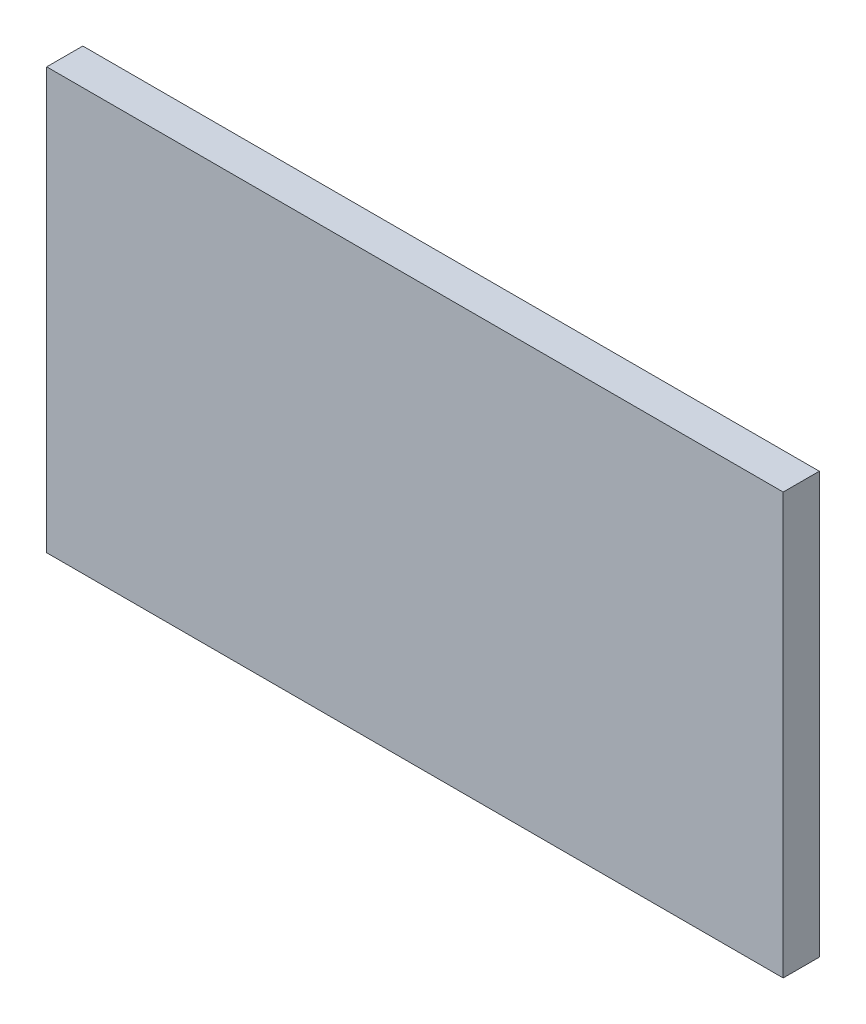
ISO-10303-21;
HEADER;
FILE_DESCRIPTION(('STEP AP214'),'2;1');
FILE_NAME('part.step','',(''),(''),'','','');
FILE_SCHEMA(('AUTOMOTIVE_DESIGN { 1 0 10303 214 1 1 1 1 }'));
ENDSEC;
DATA;
#1=APPLICATION_CONTEXT('core data for automotive mechanical design processes');
#2=APPLICATION_PROTOCOL_DEFINITION('international standard','automotive_design',2000,#1);
#3=PRODUCT_CONTEXT('',#1,'mechanical');
#4=PRODUCT('Part','Part','',(#3));
#5=PRODUCT_RELATED_PRODUCT_CATEGORY('part','',(#4));
#6=PRODUCT_DEFINITION_FORMATION('','',#4);
#7=PRODUCT_DEFINITION_CONTEXT('part definition',#1,'design');
#8=PRODUCT_DEFINITION('design','',#6,#7);
#9=PRODUCT_DEFINITION_SHAPE('','',#8);
#10=(LENGTH_UNIT() NAMED_UNIT(*) SI_UNIT(.MILLI.,.METRE.));
#11=(NAMED_UNIT(*) PLANE_ANGLE_UNIT() SI_UNIT($,.RADIAN.));
#12=(NAMED_UNIT(*) SI_UNIT($,.STERADIAN.) SOLID_ANGLE_UNIT());
#13=UNCERTAINTY_MEASURE_WITH_UNIT(LENGTH_MEASURE(1.E-05),#10,'distance_accuracy_value','');
#14=(GEOMETRIC_REPRESENTATION_CONTEXT(3) GLOBAL_UNCERTAINTY_ASSIGNED_CONTEXT((#13)) GLOBAL_UNIT_ASSIGNED_CONTEXT((#10,
#11,#12)) REPRESENTATION_CONTEXT('',''));
#15=CARTESIAN_POINT('',(0.,0.,0.));
#16=DIRECTION('',(0.,0.,1.));
#17=DIRECTION('',(1.,0.,0.));
#18=AXIS2_PLACEMENT_3D('',#15,#16,#17);
#19=CARTESIAN_POINT('',(1.65,8.0716,0.76487));
#20=DIRECTION('',(0.,0.,-1.));
#21=DIRECTION('',(0.,1.,0.));
#22=AXIS2_PLACEMENT_3D('',#19,#20,#21);
#23=PLANE('',#22);
#24=DIRECTION('',(1.,0.,0.));
#25=VECTOR('',#24,1.);
#26=CARTESIAN_POINT('',(1.3,8.2716,0.76487));
#27=LINE('',#26,#25);
#28=CARTESIAN_POINT('',(1.3,8.2716,0.76487));
#29=VERTEX_POINT('',#28);
#30=CARTESIAN_POINT('',(2.,8.2716,0.76487));
#31=VERTEX_POINT('',#30);
#32=EDGE_CURVE('E55',#29,#31,#27,.T.);
#33=ORIENTED_EDGE('',*,*,#32,.T.);
#34=DIRECTION('',(0.,1.,0.));
#35=VECTOR('',#34,1.);
#36=CARTESIAN_POINT('',(2.,8.2716,0.76487));
#37=LINE('',#36,#35);
#38=CARTESIAN_POINT('',(2.,7.8716,0.76487));
#39=VERTEX_POINT('',#38);
#40=EDGE_CURVE('E57',#31,#39,#37,.F.);
#41=ORIENTED_EDGE('',*,*,#40,.T.);
#42=DIRECTION('',(1.,0.,0.));
#43=VECTOR('',#42,1.);
#44=CARTESIAN_POINT('',(2.,7.8716,0.76487));
#45=LINE('',#44,#43);
#46=CARTESIAN_POINT('',(1.3,7.8716,0.76487));
#47=VERTEX_POINT('',#46);
#48=EDGE_CURVE('E20',#39,#47,#45,.F.);
#49=ORIENTED_EDGE('',*,*,#48,.T.);
#50=DIRECTION('',(0.,1.,0.));
#51=VECTOR('',#50,1.);
#52=CARTESIAN_POINT('',(1.3,7.8716,0.76487));
#53=LINE('',#52,#51);
#54=EDGE_CURVE('E80',#47,#29,#53,.T.);
#55=ORIENTED_EDGE('',*,*,#54,.T.);
#56=EDGE_LOOP('',(#33,#41,#49,#55));
#57=FACE_BOUND('',#56,.T.);
#58=ADVANCED_FACE('F17',(#57),#23,.T.);
#59=CARTESIAN_POINT('',(2.,7.8716,0.76487));
#60=DIRECTION('',(0.,1.,0.));
#61=DIRECTION('',(0.,0.,1.));
#62=AXIS2_PLACEMENT_3D('',#59,#60,#61);
#63=PLANE('',#62);
#64=DIRECTION('',(0.,0.,1.));
#65=VECTOR('',#64,1.);
#66=CARTESIAN_POINT('',(1.3,7.8716,0.76487));
#67=LINE('',#66,#65);
#68=CARTESIAN_POINT('',(1.3,7.8716,0.79916));
#69=VERTEX_POINT('',#68);
#70=EDGE_CURVE('E68',#69,#47,#67,.F.);
#71=ORIENTED_EDGE('',*,*,#70,.T.);
#72=ORIENTED_EDGE('',*,*,#48,.F.);
#73=DIRECTION('',(0.,0.,1.));
#74=VECTOR('',#73,1.);
#75=CARTESIAN_POINT('',(2.,7.8716,0.76487));
#76=LINE('',#75,#74);
#77=CARTESIAN_POINT('',(2.,7.8716,0.79916));
#78=VERTEX_POINT('',#77);
#79=EDGE_CURVE('E63',#39,#78,#76,.T.);
#80=ORIENTED_EDGE('',*,*,#79,.T.);
#81=DIRECTION('',(1.,0.,0.));
#82=VECTOR('',#81,1.);
#83=CARTESIAN_POINT('',(1.65,7.8716,0.79916));
#84=LINE('',#83,#82);
#85=EDGE_CURVE('E83',#69,#78,#84,.T.);
#86=ORIENTED_EDGE('',*,*,#85,.F.);
#87=EDGE_LOOP('',(#71,#72,#80,#86));
#88=FACE_BOUND('',#87,.T.);
#89=ADVANCED_FACE('F65',(#88),#63,.F.);
#90=CARTESIAN_POINT('',(2.,8.2716,0.76487));
#91=DIRECTION('',(-1.,0.,0.));
#92=DIRECTION('',(0.,0.,1.));
#93=AXIS2_PLACEMENT_3D('',#90,#91,#92);
#94=PLANE('',#93);
#95=ORIENTED_EDGE('',*,*,#79,.F.);
#96=ORIENTED_EDGE('',*,*,#40,.F.);
#97=DIRECTION('',(0.,0.,-1.));
#98=VECTOR('',#97,1.);
#99=CARTESIAN_POINT('',(2.,8.2716,0.76487));
#100=LINE('',#99,#98);
#101=CARTESIAN_POINT('',(2.,8.2716,0.79916));
#102=VERTEX_POINT('',#101);
#103=EDGE_CURVE('E75',#31,#102,#100,.F.);
#104=ORIENTED_EDGE('',*,*,#103,.T.);
#105=DIRECTION('',(0.,-1.,0.));
#106=VECTOR('',#105,1.);
#107=CARTESIAN_POINT('',(2.,8.0716,0.79916));
#108=LINE('',#107,#106);
#109=EDGE_CURVE('E72',#78,#102,#108,.F.);
#110=ORIENTED_EDGE('',*,*,#109,.F.);
#111=EDGE_LOOP('',(#95,#96,#104,#110));
#112=FACE_BOUND('',#111,.T.);
#113=ADVANCED_FACE('F70',(#112),#94,.F.);
#114=CARTESIAN_POINT('',(1.3,8.2716,0.76487));
#115=DIRECTION('',(0.,-1.,0.));
#116=DIRECTION('',(0.,0.,-1.));
#117=AXIS2_PLACEMENT_3D('',#114,#115,#116);
#118=PLANE('',#117);
#119=ORIENTED_EDGE('',*,*,#103,.F.);
#120=ORIENTED_EDGE('',*,*,#32,.F.);
#121=DIRECTION('',(0.,0.,1.));
#122=VECTOR('',#121,1.);
#123=CARTESIAN_POINT('',(1.3,8.2716,0.76487));
#124=LINE('',#123,#122);
#125=CARTESIAN_POINT('',(1.3,8.2716,0.79916));
#126=VERTEX_POINT('',#125);
#127=EDGE_CURVE('E35',#29,#126,#124,.T.);
#128=ORIENTED_EDGE('',*,*,#127,.T.);
#129=DIRECTION('',(1.,0.,0.));
#130=VECTOR('',#129,1.);
#131=CARTESIAN_POINT('',(1.65,8.2716,0.79916));
#132=LINE('',#131,#130);
#133=EDGE_CURVE('E26',#102,#126,#132,.F.);
#134=ORIENTED_EDGE('',*,*,#133,.F.);
#135=EDGE_LOOP('',(#119,#120,#128,#134));
#136=FACE_BOUND('',#135,.T.);
#137=ADVANCED_FACE('F89',(#136),#118,.F.);
#138=CARTESIAN_POINT('',(1.3,7.8716,0.76487));
#139=DIRECTION('',(1.,0.,0.));
#140=DIRECTION('',(0.,1.,0.));
#141=AXIS2_PLACEMENT_3D('',#138,#139,#140);
#142=PLANE('',#141);
#143=ORIENTED_EDGE('',*,*,#127,.F.);
#144=ORIENTED_EDGE('',*,*,#54,.F.);
#145=ORIENTED_EDGE('',*,*,#70,.F.);
#146=DIRECTION('',(0.,-1.,0.));
#147=VECTOR('',#146,1.);
#148=CARTESIAN_POINT('',(1.3,8.0716,0.79916));
#149=LINE('',#148,#147);
#150=EDGE_CURVE('E11',#126,#69,#149,.T.);
#151=ORIENTED_EDGE('',*,*,#150,.F.);
#152=EDGE_LOOP('',(#143,#144,#145,#151));
#153=FACE_BOUND('',#152,.T.);
#154=ADVANCED_FACE('F91',(#153),#142,.F.);
#155=CARTESIAN_POINT('',(1.65,8.0716,0.79916));
#156=DIRECTION('',(0.,0.,1.));
#157=DIRECTION('',(0.,-1.,0.));
#158=AXIS2_PLACEMENT_3D('',#155,#156,#157);
#159=PLANE('',#158);
#160=ORIENTED_EDGE('',*,*,#133,.T.);
#161=ORIENTED_EDGE('',*,*,#150,.T.);
#162=ORIENTED_EDGE('',*,*,#85,.T.);
#163=ORIENTED_EDGE('',*,*,#109,.T.);
#164=EDGE_LOOP('',(#160,#161,#162,#163));
#165=FACE_BOUND('',#164,.T.);
#166=ADVANCED_FACE('F88',(#165),#159,.T.);
#167=CLOSED_SHELL('',(#58,#89,#113,#137,#154,#166));
#168=MANIFOLD_SOLID_BREP('B1',#167);
#169=ADVANCED_BREP_SHAPE_REPRESENTATION('',(#18,#168),#14);
#170=SHAPE_DEFINITION_REPRESENTATION(#9,#169);
ENDSEC;
END-ISO-10303-21;
